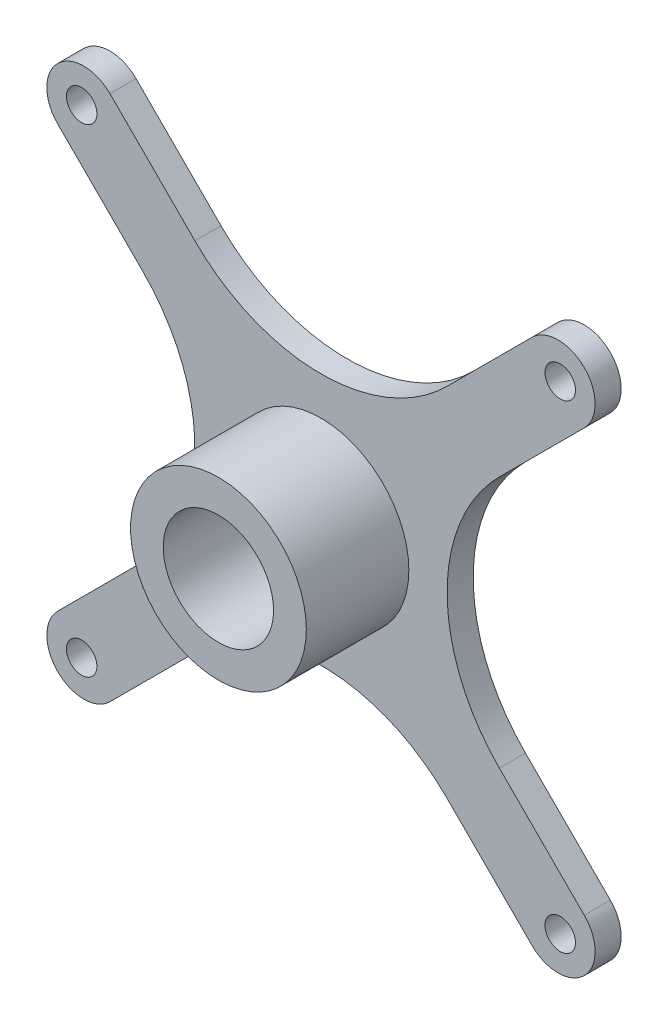
ISO-10303-21;
HEADER;
FILE_DESCRIPTION(('STEP AP214'),'2;1');
FILE_NAME('part.step','',(''),(''),'','','');
FILE_SCHEMA(('AUTOMOTIVE_DESIGN { 1 0 10303 214 1 1 1 1 }'));
ENDSEC;
DATA;
#1=APPLICATION_CONTEXT('core data for automotive mechanical design processes');
#2=APPLICATION_PROTOCOL_DEFINITION('international standard','automotive_design',2000,#1);
#3=PRODUCT_CONTEXT('',#1,'mechanical');
#4=PRODUCT('Part','Part','',(#3));
#5=PRODUCT_RELATED_PRODUCT_CATEGORY('part','',(#4));
#6=PRODUCT_DEFINITION_FORMATION('','',#4);
#7=PRODUCT_DEFINITION_CONTEXT('part definition',#1,'design');
#8=PRODUCT_DEFINITION('design','',#6,#7);
#9=PRODUCT_DEFINITION_SHAPE('','',#8);
#10=(LENGTH_UNIT() NAMED_UNIT(*) SI_UNIT(.MILLI.,.METRE.));
#11=(NAMED_UNIT(*) PLANE_ANGLE_UNIT() SI_UNIT($,.RADIAN.));
#12=(NAMED_UNIT(*) SI_UNIT($,.STERADIAN.) SOLID_ANGLE_UNIT());
#13=UNCERTAINTY_MEASURE_WITH_UNIT(LENGTH_MEASURE(1.E-05),#10,'distance_accuracy_value','');
#14=(GEOMETRIC_REPRESENTATION_CONTEXT(3) GLOBAL_UNCERTAINTY_ASSIGNED_CONTEXT((#13)) GLOBAL_UNIT_ASSIGNED_CONTEXT((#10,
#11,#12)) REPRESENTATION_CONTEXT('',''));
#15=CARTESIAN_POINT('',(0.,0.,0.));
#16=DIRECTION('',(0.,0.,1.));
#17=DIRECTION('',(1.,0.,0.));
#18=AXIS2_PLACEMENT_3D('',#15,#16,#17);
#19=CARTESIAN_POINT('',(0.,0.,1.78));
#20=DIRECTION('',(0.,0.,1.));
#21=DIRECTION('',(1.,0.,0.));
#22=AXIS2_PLACEMENT_3D('',#19,#20,#21);
#23=PLANE('',#22);
#24=CARTESIAN_POINT('',(16.3346089475665,16.3346089475661,1.78));
#25=DIRECTION('',(0.,0.,1.));
#26=DIRECTION('',(1.,0.,0.));
#27=AXIS2_PLACEMENT_3D('',#24,#25,#26);
#28=CIRCLE('',#27,1.0399999999996);
#29=CARTESIAN_POINT('',(17.3746089475661,16.3346089475661,1.78));
#30=VERTEX_POINT('',#29);
#31=EDGE_CURVE('E189',#30,#30,#28,.T.);
#32=ORIENTED_EDGE('',*,*,#31,.F.);
#33=EDGE_LOOP('',(#32));
#34=FACE_BOUND('',#33,.T.);
#35=CARTESIAN_POINT('',(-16.3346089475658,16.3346089475662,1.78));
#36=DIRECTION('',(0.,0.,1.));
#37=DIRECTION('',(1.,0.,0.));
#38=AXIS2_PLACEMENT_3D('',#35,#36,#37);
#39=CIRCLE('',#38,1.0399999999996);
#40=CARTESIAN_POINT('',(-15.2946089475662,16.3346089475662,1.78));
#41=VERTEX_POINT('',#40);
#42=EDGE_CURVE('E186',#41,#41,#39,.T.);
#43=ORIENTED_EDGE('',*,*,#42,.F.);
#44=EDGE_LOOP('',(#43));
#45=FACE_BOUND('',#44,.T.);
#46=CARTESIAN_POINT('',(-16.3346089475653,-16.3346089475656,1.78));
#47=DIRECTION('',(0.,0.,1.));
#48=DIRECTION('',(1.,0.,0.));
#49=AXIS2_PLACEMENT_3D('',#46,#47,#48);
#50=CIRCLE('',#49,1.0399999999996);
#51=CARTESIAN_POINT('',(-15.2946089475657,-16.3346089475656,1.78));
#52=VERTEX_POINT('',#51);
#53=EDGE_CURVE('E183',#52,#52,#50,.T.);
#54=ORIENTED_EDGE('',*,*,#53,.F.);
#55=EDGE_LOOP('',(#54));
#56=FACE_BOUND('',#55,.T.);
#57=CARTESIAN_POINT('',(16.3346089475664,-16.3346089475662,1.78));
#58=DIRECTION('',(0.,0.,1.));
#59=DIRECTION('',(1.,0.,0.));
#60=AXIS2_PLACEMENT_3D('',#57,#58,#59);
#61=CIRCLE('',#60,1.0399999999996);
#62=CARTESIAN_POINT('',(17.3746089475661,-16.3346089475662,1.78));
#63=VERTEX_POINT('',#62);
#64=EDGE_CURVE('E177',#63,#63,#61,.T.);
#65=ORIENTED_EDGE('',*,*,#64,.F.);
#66=EDGE_LOOP('',(#65));
#67=FACE_BOUND('',#66,.T.);
#68=DIRECTION('',(0.707106781186552,-0.707106781186543,0.));
#69=VECTOR('',#68,1.);
#70=CARTESIAN_POINT('',(-1.78544462249585,-1.78544462249587,1.78));
#71=LINE('',#70,#69);
#72=CARTESIAN_POINT('',(-17.9749999999999,14.404110755008,1.78));
#73=VERTEX_POINT('',#72);
#74=CARTESIAN_POINT('',(-12.1775605948521,8.60667134986025,1.78));
#75=VERTEX_POINT('',#74);
#76=EDGE_CURVE('E116',#73,#75,#71,.T.);
#77=ORIENTED_EDGE('',*,*,#76,.T.);
#78=CARTESIAN_POINT('',(-20.7842319447123,0.,1.78));
#79=DIRECTION('',(0.,0.,1.));
#80=DIRECTION('',(1.,0.,0.));
#81=AXIS2_PLACEMENT_3D('',#78,#79,#80);
#82=CIRCLE('',#81,12.1716713498603);
#83=CARTESIAN_POINT('',(-12.1775605948521,-8.60667134986025,1.78));
#84=VERTEX_POINT('',#83);
#85=EDGE_CURVE('E676',#84,#75,#82,.T.);
#86=ORIENTED_EDGE('',*,*,#85,.F.);
#87=DIRECTION('',(0.707106781186552,0.707106781186543,0.));
#88=VECTOR('',#87,1.);
#89=CARTESIAN_POINT('',(-1.78544462249586,1.78544462249588,1.78));
#90=LINE('',#89,#88);
#91=CARTESIAN_POINT('',(-17.9749999999999,-14.404110755008,1.78));
#92=VERTEX_POINT('',#91);
#93=EDGE_CURVE('E280',#92,#84,#90,.T.);
#94=ORIENTED_EDGE('',*,*,#93,.F.);
#95=CARTESIAN_POINT('',(-16.1895553775038,-16.1895553775041,1.78));
#96=DIRECTION('',(0.,0.,1.));
#97=DIRECTION('',(1.,0.,0.));
#98=AXIS2_PLACEMENT_3D('',#95,#96,#97);
#99=CIRCLE('',#98,2.52500000000009);
#100=CARTESIAN_POINT('',(-14.4041107550077,-17.9750000000002,1.78));
#101=VERTEX_POINT('',#100);
#102=EDGE_CURVE('E302',#92,#101,#99,.T.);
#103=ORIENTED_EDGE('',*,*,#102,.T.);
#104=DIRECTION('',(0.707106781186543,0.707106781186552,0.));
#105=VECTOR('',#104,1.);
#106=CARTESIAN_POINT('',(1.78544462249618,-1.78544462249615,1.78));
#107=LINE('',#106,#105);
#108=CARTESIAN_POINT('',(-8.60667134985995,-12.1775605948524,1.78));
#109=VERTEX_POINT('',#108);
#110=EDGE_CURVE('E298',#101,#109,#107,.T.);
#111=ORIENTED_EDGE('',*,*,#110,.T.);
#112=CARTESIAN_POINT('',(3.05659886288592E-13,-20.7842319447126,1.78));
#113=DIRECTION('',(0.,0.,1.));
#114=DIRECTION('',(1.,0.,0.));
#115=AXIS2_PLACEMENT_3D('',#112,#113,#114);
#116=CIRCLE('',#115,12.1716713498603);
#117=CARTESIAN_POINT('',(8.60667134986056,-12.1775605948524,1.78));
#118=VERTEX_POINT('',#117);
#119=EDGE_CURVE('E301',#118,#109,#116,.T.);
#120=ORIENTED_EDGE('',*,*,#119,.F.);
#121=DIRECTION('',(-0.707106781186544,0.707106781186552,0.));
#122=VECTOR('',#121,1.);
#123=CARTESIAN_POINT('',(-1.78544462249588,-1.78544462249586,1.78));
#124=LINE('',#123,#122);
#125=CARTESIAN_POINT('',(14.4041107550083,-17.9750000000002,1.78));
#126=VERTEX_POINT('',#125);
#127=EDGE_CURVE('E304',#126,#118,#124,.T.);
#128=ORIENTED_EDGE('',*,*,#127,.F.);
#129=CARTESIAN_POINT('',(16.1895553775044,-16.1895553775041,1.78));
#130=DIRECTION('',(0.,0.,1.));
#131=DIRECTION('',(1.,0.,0.));
#132=AXIS2_PLACEMENT_3D('',#129,#130,#131);
#133=CIRCLE('',#132,2.52500000000009);
#134=CARTESIAN_POINT('',(17.9750000000005,-14.404110755008,1.78));
#135=VERTEX_POINT('',#134);
#136=EDGE_CURVE('E311',#126,#135,#133,.T.);
#137=ORIENTED_EDGE('',*,*,#136,.T.);
#138=DIRECTION('',(-0.707106781186552,0.707106781186543,0.));
#139=VECTOR('',#138,1.);
#140=CARTESIAN_POINT('',(1.78544462249615,1.78544462249618,1.78));
#141=LINE('',#140,#139);
#142=CARTESIAN_POINT('',(12.1775605948527,-8.60667134986025,1.78));
#143=VERTEX_POINT('',#142);
#144=EDGE_CURVE('E313',#135,#143,#141,.T.);
#145=ORIENTED_EDGE('',*,*,#144,.T.);
#146=CARTESIAN_POINT('',(20.7842319447129,0.,1.78));
#147=DIRECTION('',(0.,0.,1.));
#148=DIRECTION('',(1.,0.,0.));
#149=AXIS2_PLACEMENT_3D('',#146,#147,#148);
#150=CIRCLE('',#149,12.1716713498603);
#151=CARTESIAN_POINT('',(12.1775605948527,8.60667134986026,1.78));
#152=VERTEX_POINT('',#151);
#153=EDGE_CURVE('E315',#152,#143,#150,.T.);
#154=ORIENTED_EDGE('',*,*,#153,.F.);
#155=DIRECTION('',(-0.707106781186552,-0.707106781186543,0.));
#156=VECTOR('',#155,1.);
#157=CARTESIAN_POINT('',(1.78544462249616,-1.78544462249618,1.78));
#158=LINE('',#157,#156);
#159=CARTESIAN_POINT('',(17.9750000000005,14.404110755008,1.78));
#160=VERTEX_POINT('',#159);
#161=EDGE_CURVE('E318',#160,#152,#158,.T.);
#162=ORIENTED_EDGE('',*,*,#161,.F.);
#163=CARTESIAN_POINT('',(16.1895553775044,16.1895553775041,1.78));
#164=DIRECTION('',(0.,0.,1.));
#165=DIRECTION('',(1.,0.,0.));
#166=AXIS2_PLACEMENT_3D('',#163,#164,#165);
#167=CIRCLE('',#166,2.52500000000009);
#168=CARTESIAN_POINT('',(14.4041107550083,17.9750000000002,1.78));
#169=VERTEX_POINT('',#168);
#170=EDGE_CURVE('E321',#160,#169,#167,.T.);
#171=ORIENTED_EDGE('',*,*,#170,.T.);
#172=DIRECTION('',(-0.707106781186543,-0.707106781186552,0.));
#173=VECTOR('',#172,1.);
#174=CARTESIAN_POINT('',(-1.78544462249587,1.78544462249585,1.78));
#175=LINE('',#174,#173);
#176=CARTESIAN_POINT('',(8.60667134986056,12.1775605948524,1.78));
#177=VERTEX_POINT('',#176);
#178=EDGE_CURVE('E172',#169,#177,#175,.T.);
#179=ORIENTED_EDGE('',*,*,#178,.T.);
#180=CARTESIAN_POINT('',(3.00569217664203E-13,20.7842319447126,1.78));
#181=DIRECTION('',(0.,0.,1.));
#182=DIRECTION('',(1.,0.,0.));
#183=AXIS2_PLACEMENT_3D('',#180,#181,#182);
#184=CIRCLE('',#183,12.1716713498603);
#185=CARTESIAN_POINT('',(-8.60667134985995,12.1775605948524,1.78));
#186=VERTEX_POINT('',#185);
#187=EDGE_CURVE('E160',#186,#177,#184,.T.);
#188=ORIENTED_EDGE('',*,*,#187,.F.);
#189=DIRECTION('',(0.707106781186544,-0.707106781186552,0.));
#190=VECTOR('',#189,1.);
#191=CARTESIAN_POINT('',(1.78544462249618,1.78544462249616,1.78));
#192=LINE('',#191,#190);
#193=CARTESIAN_POINT('',(-14.4041107550077,17.9750000000002,1.78));
#194=VERTEX_POINT('',#193);
#195=EDGE_CURVE('E170',#194,#186,#192,.T.);
#196=ORIENTED_EDGE('',*,*,#195,.F.);
#197=CARTESIAN_POINT('',(-16.1895553775038,16.1895553775041,1.78));
#198=DIRECTION('',(0.,0.,1.));
#199=DIRECTION('',(1.,0.,0.));
#200=AXIS2_PLACEMENT_3D('',#197,#198,#199);
#201=CIRCLE('',#200,2.52500000000009);
#202=EDGE_CURVE('E56',#194,#73,#201,.T.);
#203=ORIENTED_EDGE('',*,*,#202,.T.);
#204=EDGE_LOOP('',(#77,#86,#94,#103,#111,#120,#128,#137,#145,#154,#162,#171,#179,#188,#196,#203));
#205=FACE_BOUND('',#204,.T.);
#206=CARTESIAN_POINT('',(0.,0.,1.78));
#207=DIRECTION('',(0.,0.,1.));
#208=DIRECTION('',(1.,0.,0.));
#209=AXIS2_PLACEMENT_3D('',#206,#207,#208);
#210=CIRCLE('',#209,6.);
#211=CARTESIAN_POINT('',(6.,0.,1.78));
#212=VERTEX_POINT('',#211);
#213=EDGE_CURVE('E668',#212,#212,#210,.T.);
#214=ORIENTED_EDGE('',*,*,#213,.F.);
#215=EDGE_LOOP('',(#214));
#216=FACE_BOUND('',#215,.T.);
#217=ADVANCED_FACE('F39',(#34,#45,#56,#67,#205,#216),#23,.T.);
#218=CARTESIAN_POINT('',(-1.78544462249585,-1.78544462249587,1.78));
#219=DIRECTION('',(0.707106781186543,0.707106781186552,0.));
#220=DIRECTION('',(-0.707106781186552,0.707106781186543,0.));
#221=AXIS2_PLACEMENT_3D('',#218,#219,#220);
#222=PLANE('',#221);
#223=DIRECTION('',(0.707106781186552,-0.707106781186543,0.));
#224=VECTOR('',#223,1.);
#225=CARTESIAN_POINT('',(-1.78544462249585,-1.78544462249587,0.));
#226=LINE('',#225,#224);
#227=CARTESIAN_POINT('',(-17.9749999999999,14.404110755008,0.));
#228=VERTEX_POINT('',#227);
#229=CARTESIAN_POINT('',(-12.1775605948521,8.60667134986025,0.));
#230=VERTEX_POINT('',#229);
#231=EDGE_CURVE('E193',#228,#230,#226,.T.);
#232=ORIENTED_EDGE('',*,*,#231,.T.);
#233=DIRECTION('',(0.,0.,-1.));
#234=VECTOR('',#233,1.);
#235=CARTESIAN_POINT('',(-12.1775605948521,8.60667134986025,1.78));
#236=LINE('',#235,#234);
#237=EDGE_CURVE('E11',#75,#230,#236,.T.);
#238=ORIENTED_EDGE('',*,*,#237,.F.);
#239=ORIENTED_EDGE('',*,*,#76,.F.);
#240=DIRECTION('',(0.,0.,-1.));
#241=VECTOR('',#240,1.);
#242=CARTESIAN_POINT('',(-17.9749999999999,14.404110755008,1.78));
#243=LINE('',#242,#241);
#244=EDGE_CURVE('E192',#73,#228,#243,.T.);
#245=ORIENTED_EDGE('',*,*,#244,.T.);
#246=EDGE_LOOP('',(#232,#238,#239,#245));
#247=FACE_BOUND('',#246,.T.);
#248=ADVANCED_FACE('F41',(#247),#222,.F.);
#249=CARTESIAN_POINT('',(-20.7842319447123,0.,1.78));
#250=DIRECTION('',(0.,0.,-1.));
#251=DIRECTION('',(-1.,0.,0.));
#252=AXIS2_PLACEMENT_3D('',#249,#250,#251);
#253=CYLINDRICAL_SURFACE('',#252,12.1716713498603);
#254=CARTESIAN_POINT('',(-20.7842319447123,0.,0.));
#255=DIRECTION('',(0.,0.,1.));
#256=DIRECTION('',(1.,0.,0.));
#257=AXIS2_PLACEMENT_3D('',#254,#255,#256);
#258=CIRCLE('',#257,12.1716713498603);
#259=CARTESIAN_POINT('',(-12.1775605948521,-8.60667134986025,0.));
#260=VERTEX_POINT('',#259);
#261=EDGE_CURVE('E196',#260,#230,#258,.T.);
#262=ORIENTED_EDGE('',*,*,#261,.F.);
#263=DIRECTION('',(0.,0.,-1.));
#264=VECTOR('',#263,1.);
#265=CARTESIAN_POINT('',(-12.1775605948521,-8.60667134986025,1.78));
#266=LINE('',#265,#264);
#267=EDGE_CURVE('E48',#84,#260,#266,.T.);
#268=ORIENTED_EDGE('',*,*,#267,.F.);
#269=ORIENTED_EDGE('',*,*,#85,.T.);
#270=ORIENTED_EDGE('',*,*,#237,.T.);
#271=EDGE_LOOP('',(#262,#268,#269,#270));
#272=FACE_BOUND('',#271,.T.);
#273=ADVANCED_FACE('F283',(#272),#253,.F.);
#274=CARTESIAN_POINT('',(-1.78544462249586,1.78544462249588,1.78));
#275=DIRECTION('',(-0.707106781186543,0.707106781186552,0.));
#276=DIRECTION('',(-0.707106781186552,-0.707106781186543,0.));
#277=AXIS2_PLACEMENT_3D('',#274,#275,#276);
#278=PLANE('',#277);
#279=DIRECTION('',(0.707106781186552,0.707106781186543,0.));
#280=VECTOR('',#279,1.);
#281=CARTESIAN_POINT('',(-1.78544462249586,1.78544462249588,0.));
#282=LINE('',#281,#280);
#283=CARTESIAN_POINT('',(-17.9749999999999,-14.404110755008,0.));
#284=VERTEX_POINT('',#283);
#285=EDGE_CURVE('E200',#284,#260,#282,.T.);
#286=ORIENTED_EDGE('',*,*,#285,.F.);
#287=DIRECTION('',(0.,0.,-1.));
#288=VECTOR('',#287,1.);
#289=CARTESIAN_POINT('',(-17.9749999999999,-14.404110755008,1.78));
#290=LINE('',#289,#288);
#291=EDGE_CURVE('E273',#92,#284,#290,.T.);
#292=ORIENTED_EDGE('',*,*,#291,.F.);
#293=ORIENTED_EDGE('',*,*,#93,.T.);
#294=ORIENTED_EDGE('',*,*,#267,.T.);
#295=EDGE_LOOP('',(#286,#292,#293,#294));
#296=FACE_BOUND('',#295,.T.);
#297=ADVANCED_FACE('F278',(#296),#278,.T.);
#298=CARTESIAN_POINT('',(-16.1895553775038,-16.1895553775041,1.78));
#299=DIRECTION('',(0.,0.,-1.));
#300=DIRECTION('',(-1.,0.,0.));
#301=AXIS2_PLACEMENT_3D('',#298,#299,#300);
#302=CYLINDRICAL_SURFACE('',#301,2.52500000000009);
#303=CARTESIAN_POINT('',(-16.1895553775038,-16.1895553775041,0.));
#304=DIRECTION('',(0.,0.,1.));
#305=DIRECTION('',(1.,0.,0.));
#306=AXIS2_PLACEMENT_3D('',#303,#304,#305);
#307=CIRCLE('',#306,2.52500000000009);
#308=CARTESIAN_POINT('',(-14.4041107550077,-17.9750000000002,0.));
#309=VERTEX_POINT('',#308);
#310=EDGE_CURVE('E203',#284,#309,#307,.T.);
#311=ORIENTED_EDGE('',*,*,#310,.T.);
#312=DIRECTION('',(0.,0.,-1.));
#313=VECTOR('',#312,1.);
#314=CARTESIAN_POINT('',(-14.4041107550077,-17.9750000000002,1.78));
#315=LINE('',#314,#313);
#316=EDGE_CURVE('E270',#101,#309,#315,.T.);
#317=ORIENTED_EDGE('',*,*,#316,.F.);
#318=ORIENTED_EDGE('',*,*,#102,.F.);
#319=ORIENTED_EDGE('',*,*,#291,.T.);
#320=EDGE_LOOP('',(#311,#317,#318,#319));
#321=FACE_BOUND('',#320,.T.);
#322=ADVANCED_FACE('F292',(#321),#302,.T.);
#323=CARTESIAN_POINT('',(1.78544462249618,-1.78544462249615,1.78));
#324=DIRECTION('',(-0.707106781186552,0.707106781186543,0.));
#325=DIRECTION('',(-0.707106781186543,-0.707106781186552,0.));
#326=AXIS2_PLACEMENT_3D('',#323,#324,#325);
#327=PLANE('',#326);
#328=DIRECTION('',(0.707106781186543,0.707106781186552,0.));
#329=VECTOR('',#328,1.);
#330=CARTESIAN_POINT('',(1.78544462249618,-1.78544462249615,0.));
#331=LINE('',#330,#329);
#332=CARTESIAN_POINT('',(-8.60667134985995,-12.1775605948524,0.));
#333=VERTEX_POINT('',#332);
#334=EDGE_CURVE('E205',#309,#333,#331,.T.);
#335=ORIENTED_EDGE('',*,*,#334,.T.);
#336=DIRECTION('',(0.,0.,-1.));
#337=VECTOR('',#336,1.);
#338=CARTESIAN_POINT('',(-8.60667134985995,-12.1775605948524,1.78));
#339=LINE('',#338,#337);
#340=EDGE_CURVE('E268',#109,#333,#339,.T.);
#341=ORIENTED_EDGE('',*,*,#340,.F.);
#342=ORIENTED_EDGE('',*,*,#110,.F.);
#343=ORIENTED_EDGE('',*,*,#316,.T.);
#344=EDGE_LOOP('',(#335,#341,#342,#343));
#345=FACE_BOUND('',#344,.T.);
#346=ADVANCED_FACE('F296',(#345),#327,.F.);
#347=CARTESIAN_POINT('',(3.05659886288592E-13,-20.7842319447126,1.78));
#348=DIRECTION('',(0.,0.,-1.));
#349=DIRECTION('',(-1.,0.,0.));
#350=AXIS2_PLACEMENT_3D('',#347,#348,#349);
#351=CYLINDRICAL_SURFACE('',#350,12.1716713498603);
#352=CARTESIAN_POINT('',(3.05659886288592E-13,-20.7842319447126,0.));
#353=DIRECTION('',(0.,0.,1.));
#354=DIRECTION('',(1.,0.,0.));
#355=AXIS2_PLACEMENT_3D('',#352,#353,#354);
#356=CIRCLE('',#355,12.1716713498603);
#357=CARTESIAN_POINT('',(8.60667134986056,-12.1775605948524,0.));
#358=VERTEX_POINT('',#357);
#359=EDGE_CURVE('E208',#358,#333,#356,.T.);
#360=ORIENTED_EDGE('',*,*,#359,.F.);
#361=DIRECTION('',(0.,0.,-1.));
#362=VECTOR('',#361,1.);
#363=CARTESIAN_POINT('',(8.60667134986056,-12.1775605948524,1.78));
#364=LINE('',#363,#362);
#365=EDGE_CURVE('E266',#118,#358,#364,.T.);
#366=ORIENTED_EDGE('',*,*,#365,.F.);
#367=ORIENTED_EDGE('',*,*,#119,.T.);
#368=ORIENTED_EDGE('',*,*,#340,.T.);
#369=EDGE_LOOP('',(#360,#366,#367,#368));
#370=FACE_BOUND('',#369,.T.);
#371=ADVANCED_FACE('F542',(#370),#351,.F.);
#372=CARTESIAN_POINT('',(-1.78544462249588,-1.78544462249586,1.78));
#373=DIRECTION('',(-0.707106781186551,-0.707106781186543,0.));
#374=DIRECTION('',(0.707106781186543,-0.707106781186552,0.));
#375=AXIS2_PLACEMENT_3D('',#372,#373,#374);
#376=PLANE('',#375);
#377=DIRECTION('',(-0.707106781186544,0.707106781186552,0.));
#378=VECTOR('',#377,1.);
#379=CARTESIAN_POINT('',(-1.78544462249588,-1.78544462249586,0.));
#380=LINE('',#379,#378);
#381=CARTESIAN_POINT('',(14.4041107550083,-17.9750000000002,0.));
#382=VERTEX_POINT('',#381);
#383=EDGE_CURVE('E211',#382,#358,#380,.T.);
#384=ORIENTED_EDGE('',*,*,#383,.F.);
#385=DIRECTION('',(0.,0.,-1.));
#386=VECTOR('',#385,1.);
#387=CARTESIAN_POINT('',(14.4041107550083,-17.9750000000002,1.78));
#388=LINE('',#387,#386);
#389=EDGE_CURVE('E264',#126,#382,#388,.T.);
#390=ORIENTED_EDGE('',*,*,#389,.F.);
#391=ORIENTED_EDGE('',*,*,#127,.T.);
#392=ORIENTED_EDGE('',*,*,#365,.T.);
#393=EDGE_LOOP('',(#384,#390,#391,#392));
#394=FACE_BOUND('',#393,.T.);
#395=ADVANCED_FACE('F533',(#394),#376,.T.);
#396=CARTESIAN_POINT('',(16.1895553775044,-16.1895553775041,1.78));
#397=DIRECTION('',(0.,0.,-1.));
#398=DIRECTION('',(-1.,0.,0.));
#399=AXIS2_PLACEMENT_3D('',#396,#397,#398);
#400=CYLINDRICAL_SURFACE('',#399,2.52500000000009);
#401=CARTESIAN_POINT('',(16.1895553775044,-16.1895553775041,0.));
#402=DIRECTION('',(0.,0.,1.));
#403=DIRECTION('',(1.,0.,0.));
#404=AXIS2_PLACEMENT_3D('',#401,#402,#403);
#405=CIRCLE('',#404,2.52500000000009);
#406=CARTESIAN_POINT('',(17.9750000000005,-14.404110755008,0.));
#407=VERTEX_POINT('',#406);
#408=EDGE_CURVE('E214',#382,#407,#405,.T.);
#409=ORIENTED_EDGE('',*,*,#408,.T.);
#410=DIRECTION('',(0.,0.,-1.));
#411=VECTOR('',#410,1.);
#412=CARTESIAN_POINT('',(17.9750000000005,-14.404110755008,1.78));
#413=LINE('',#412,#411);
#414=EDGE_CURVE('E261',#135,#407,#413,.T.);
#415=ORIENTED_EDGE('',*,*,#414,.F.);
#416=ORIENTED_EDGE('',*,*,#136,.F.);
#417=ORIENTED_EDGE('',*,*,#389,.T.);
#418=EDGE_LOOP('',(#409,#415,#416,#417));
#419=FACE_BOUND('',#418,.T.);
#420=ADVANCED_FACE('F522',(#419),#400,.T.);
#421=CARTESIAN_POINT('',(1.78544462249615,1.78544462249618,1.78));
#422=DIRECTION('',(-0.707106781186543,-0.707106781186552,0.));
#423=DIRECTION('',(0.707106781186552,-0.707106781186543,0.));
#424=AXIS2_PLACEMENT_3D('',#421,#422,#423);
#425=PLANE('',#424);
#426=DIRECTION('',(-0.707106781186552,0.707106781186543,0.));
#427=VECTOR('',#426,1.);
#428=CARTESIAN_POINT('',(1.78544462249615,1.78544462249618,0.));
#429=LINE('',#428,#427);
#430=CARTESIAN_POINT('',(12.1775605948527,-8.60667134986025,0.));
#431=VERTEX_POINT('',#430);
#432=EDGE_CURVE('E216',#407,#431,#429,.T.);
#433=ORIENTED_EDGE('',*,*,#432,.T.);
#434=DIRECTION('',(0.,0.,-1.));
#435=VECTOR('',#434,1.);
#436=CARTESIAN_POINT('',(12.1775605948527,-8.60667134986025,1.78));
#437=LINE('',#436,#435);
#438=EDGE_CURVE('E259',#143,#431,#437,.T.);
#439=ORIENTED_EDGE('',*,*,#438,.F.);
#440=ORIENTED_EDGE('',*,*,#144,.F.);
#441=ORIENTED_EDGE('',*,*,#414,.T.);
#442=EDGE_LOOP('',(#433,#439,#440,#441));
#443=FACE_BOUND('',#442,.T.);
#444=ADVANCED_FACE('F512',(#443),#425,.F.);
#445=CARTESIAN_POINT('',(20.7842319447129,0.,1.78));
#446=DIRECTION('',(0.,0.,-1.));
#447=DIRECTION('',(-1.,0.,0.));
#448=AXIS2_PLACEMENT_3D('',#445,#446,#447);
#449=CYLINDRICAL_SURFACE('',#448,12.1716713498603);
#450=CARTESIAN_POINT('',(20.7842319447129,0.,0.));
#451=DIRECTION('',(0.,0.,1.));
#452=DIRECTION('',(1.,0.,0.));
#453=AXIS2_PLACEMENT_3D('',#450,#451,#452);
#454=CIRCLE('',#453,12.1716713498603);
#455=CARTESIAN_POINT('',(12.1775605948527,8.60667134986026,0.));
#456=VERTEX_POINT('',#455);
#457=EDGE_CURVE('E219',#456,#431,#454,.T.);
#458=ORIENTED_EDGE('',*,*,#457,.F.);
#459=DIRECTION('',(0.,0.,-1.));
#460=VECTOR('',#459,1.);
#461=CARTESIAN_POINT('',(12.1775605948527,8.60667134986026,1.78));
#462=LINE('',#461,#460);
#463=EDGE_CURVE('E257',#152,#456,#462,.T.);
#464=ORIENTED_EDGE('',*,*,#463,.F.);
#465=ORIENTED_EDGE('',*,*,#153,.T.);
#466=ORIENTED_EDGE('',*,*,#438,.T.);
#467=EDGE_LOOP('',(#458,#464,#465,#466));
#468=FACE_BOUND('',#467,.T.);
#469=ADVANCED_FACE('F502',(#468),#449,.F.);
#470=CARTESIAN_POINT('',(1.78544462249616,-1.78544462249618,1.78));
#471=DIRECTION('',(0.707106781186543,-0.707106781186552,0.));
#472=DIRECTION('',(0.707106781186552,0.707106781186543,0.));
#473=AXIS2_PLACEMENT_3D('',#470,#471,#472);
#474=PLANE('',#473);
#475=DIRECTION('',(-0.707106781186552,-0.707106781186543,0.));
#476=VECTOR('',#475,1.);
#477=CARTESIAN_POINT('',(1.78544462249616,-1.78544462249618,0.));
#478=LINE('',#477,#476);
#479=CARTESIAN_POINT('',(17.9750000000005,14.404110755008,0.));
#480=VERTEX_POINT('',#479);
#481=EDGE_CURVE('E222',#480,#456,#478,.T.);
#482=ORIENTED_EDGE('',*,*,#481,.F.);
#483=DIRECTION('',(0.,0.,-1.));
#484=VECTOR('',#483,1.);
#485=CARTESIAN_POINT('',(17.9750000000005,14.404110755008,1.78));
#486=LINE('',#485,#484);
#487=EDGE_CURVE('E255',#160,#480,#486,.T.);
#488=ORIENTED_EDGE('',*,*,#487,.F.);
#489=ORIENTED_EDGE('',*,*,#161,.T.);
#490=ORIENTED_EDGE('',*,*,#463,.T.);
#491=EDGE_LOOP('',(#482,#488,#489,#490));
#492=FACE_BOUND('',#491,.T.);
#493=ADVANCED_FACE('F494',(#492),#474,.T.);
#494=CARTESIAN_POINT('',(16.1895553775044,16.1895553775041,1.78));
#495=DIRECTION('',(0.,0.,-1.));
#496=DIRECTION('',(-1.,0.,0.));
#497=AXIS2_PLACEMENT_3D('',#494,#495,#496);
#498=CYLINDRICAL_SURFACE('',#497,2.52500000000009);
#499=CARTESIAN_POINT('',(16.1895553775044,16.1895553775041,0.));
#500=DIRECTION('',(0.,0.,1.));
#501=DIRECTION('',(1.,0.,0.));
#502=AXIS2_PLACEMENT_3D('',#499,#500,#501);
#503=CIRCLE('',#502,2.52500000000009);
#504=CARTESIAN_POINT('',(14.4041107550083,17.9750000000002,0.));
#505=VERTEX_POINT('',#504);
#506=EDGE_CURVE('E225',#480,#505,#503,.T.);
#507=ORIENTED_EDGE('',*,*,#506,.T.);
#508=DIRECTION('',(0.,0.,-1.));
#509=VECTOR('',#508,1.);
#510=CARTESIAN_POINT('',(14.4041107550083,17.9750000000002,1.78));
#511=LINE('',#510,#509);
#512=EDGE_CURVE('E252',#169,#505,#511,.T.);
#513=ORIENTED_EDGE('',*,*,#512,.F.);
#514=ORIENTED_EDGE('',*,*,#170,.F.);
#515=ORIENTED_EDGE('',*,*,#487,.T.);
#516=EDGE_LOOP('',(#507,#513,#514,#515));
#517=FACE_BOUND('',#516,.T.);
#518=ADVANCED_FACE('F327',(#517),#498,.T.);
#519=CARTESIAN_POINT('',(-1.78544462249587,1.78544462249585,1.78));
#520=DIRECTION('',(0.707106781186552,-0.707106781186543,0.));
#521=DIRECTION('',(0.707106781186543,0.707106781186552,0.));
#522=AXIS2_PLACEMENT_3D('',#519,#520,#521);
#523=PLANE('',#522);
#524=DIRECTION('',(-0.707106781186543,-0.707106781186552,0.));
#525=VECTOR('',#524,1.);
#526=CARTESIAN_POINT('',(-1.78544462249587,1.78544462249585,0.));
#527=LINE('',#526,#525);
#528=CARTESIAN_POINT('',(8.60667134986056,12.1775605948524,0.));
#529=VERTEX_POINT('',#528);
#530=EDGE_CURVE('E227',#505,#529,#527,.T.);
#531=ORIENTED_EDGE('',*,*,#530,.T.);
#532=DIRECTION('',(0.,0.,-1.));
#533=VECTOR('',#532,1.);
#534=CARTESIAN_POINT('',(8.60667134986056,12.1775605948524,1.78));
#535=LINE('',#534,#533);
#536=EDGE_CURVE('E167',#177,#529,#535,.T.);
#537=ORIENTED_EDGE('',*,*,#536,.F.);
#538=ORIENTED_EDGE('',*,*,#178,.F.);
#539=ORIENTED_EDGE('',*,*,#512,.T.);
#540=EDGE_LOOP('',(#531,#537,#538,#539));
#541=FACE_BOUND('',#540,.T.);
#542=ADVANCED_FACE('F331',(#541),#523,.F.);
#543=CARTESIAN_POINT('',(3.00569217664203E-13,20.7842319447126,1.78));
#544=DIRECTION('',(0.,0.,-1.));
#545=DIRECTION('',(-1.,0.,0.));
#546=AXIS2_PLACEMENT_3D('',#543,#544,#545);
#547=CYLINDRICAL_SURFACE('',#546,12.1716713498603);
#548=CARTESIAN_POINT('',(3.00569217664203E-13,20.7842319447126,0.));
#549=DIRECTION('',(0.,0.,1.));
#550=DIRECTION('',(1.,0.,0.));
#551=AXIS2_PLACEMENT_3D('',#548,#549,#550);
#552=CIRCLE('',#551,12.1716713498603);
#553=CARTESIAN_POINT('',(-8.60667134985995,12.1775605948524,0.));
#554=VERTEX_POINT('',#553);
#555=EDGE_CURVE('E162',#554,#529,#552,.T.);
#556=ORIENTED_EDGE('',*,*,#555,.F.);
#557=DIRECTION('',(0.,0.,-1.));
#558=VECTOR('',#557,1.);
#559=CARTESIAN_POINT('',(-8.60667134985995,12.1775605948524,1.78));
#560=LINE('',#559,#558);
#561=EDGE_CURVE('E157',#186,#554,#560,.T.);
#562=ORIENTED_EDGE('',*,*,#561,.F.);
#563=ORIENTED_EDGE('',*,*,#187,.T.);
#564=ORIENTED_EDGE('',*,*,#536,.T.);
#565=EDGE_LOOP('',(#556,#562,#563,#564));
#566=FACE_BOUND('',#565,.T.);
#567=ADVANCED_FACE('F159',(#566),#547,.F.);
#568=CARTESIAN_POINT('',(1.78544462249618,1.78544462249616,1.78));
#569=DIRECTION('',(0.707106781186551,0.707106781186543,0.));
#570=DIRECTION('',(-0.707106781186543,0.707106781186552,0.));
#571=AXIS2_PLACEMENT_3D('',#568,#569,#570);
#572=PLANE('',#571);
#573=DIRECTION('',(0.707106781186544,-0.707106781186552,0.));
#574=VECTOR('',#573,1.);
#575=CARTESIAN_POINT('',(1.78544462249618,1.78544462249616,0.));
#576=LINE('',#575,#574);
#577=CARTESIAN_POINT('',(-14.4041107550077,17.9750000000002,0.));
#578=VERTEX_POINT('',#577);
#579=EDGE_CURVE('E231',#578,#554,#576,.T.);
#580=ORIENTED_EDGE('',*,*,#579,.F.);
#581=DIRECTION('',(0.,0.,-1.));
#582=VECTOR('',#581,1.);
#583=CARTESIAN_POINT('',(-14.4041107550077,17.9750000000002,1.78));
#584=LINE('',#583,#582);
#585=EDGE_CURVE('E107',#194,#578,#584,.T.);
#586=ORIENTED_EDGE('',*,*,#585,.F.);
#587=ORIENTED_EDGE('',*,*,#195,.T.);
#588=ORIENTED_EDGE('',*,*,#561,.T.);
#589=EDGE_LOOP('',(#580,#586,#587,#588));
#590=FACE_BOUND('',#589,.T.);
#591=ADVANCED_FACE('F175',(#590),#572,.T.);
#592=CARTESIAN_POINT('',(-16.3346089475658,16.3346089475662,1.78));
#593=DIRECTION('',(0.,0.,-1.));
#594=DIRECTION('',(-1.,0.,0.));
#595=AXIS2_PLACEMENT_3D('',#592,#593,#594);
#596=CYLINDRICAL_SURFACE('',#595,1.0399999999996);
#597=ORIENTED_EDGE('',*,*,#42,.T.);
#598=EDGE_LOOP('',(#597));
#599=FACE_BOUND('',#598,.T.);
#600=CARTESIAN_POINT('',(-16.3346089475658,16.3346089475662,0.));
#601=DIRECTION('',(0.,0.,1.));
#602=DIRECTION('',(1.,0.,0.));
#603=AXIS2_PLACEMENT_3D('',#600,#601,#602);
#604=CIRCLE('',#603,1.0399999999996);
#605=CARTESIAN_POINT('',(-15.2946089475662,16.3346089475662,0.));
#606=VERTEX_POINT('',#605);
#607=EDGE_CURVE('E243',#606,#606,#604,.T.);
#608=ORIENTED_EDGE('',*,*,#607,.F.);
#609=EDGE_LOOP('',(#608));
#610=FACE_BOUND('',#609,.T.);
#611=ADVANCED_FACE('F363',(#599,#610),#596,.F.);
#612=CARTESIAN_POINT('',(-16.3346089475653,-16.3346089475656,1.78));
#613=DIRECTION('',(0.,0.,-1.));
#614=DIRECTION('',(-1.,0.,0.));
#615=AXIS2_PLACEMENT_3D('',#612,#613,#614);
#616=CYLINDRICAL_SURFACE('',#615,1.0399999999996);
#617=ORIENTED_EDGE('',*,*,#53,.T.);
#618=EDGE_LOOP('',(#617));
#619=FACE_BOUND('',#618,.T.);
#620=CARTESIAN_POINT('',(-16.3346089475653,-16.3346089475656,0.));
#621=DIRECTION('',(0.,0.,1.));
#622=DIRECTION('',(1.,0.,0.));
#623=AXIS2_PLACEMENT_3D('',#620,#621,#622);
#624=CIRCLE('',#623,1.0399999999996);
#625=CARTESIAN_POINT('',(-15.2946089475657,-16.3346089475656,0.));
#626=VERTEX_POINT('',#625);
#627=EDGE_CURVE('E240',#626,#626,#624,.T.);
#628=ORIENTED_EDGE('',*,*,#627,.F.);
#629=EDGE_LOOP('',(#628));
#630=FACE_BOUND('',#629,.T.);
#631=ADVANCED_FACE('F366',(#619,#630),#616,.F.);
#632=CARTESIAN_POINT('',(16.3346089475664,-16.3346089475662,1.78));
#633=DIRECTION('',(0.,0.,-1.));
#634=DIRECTION('',(-1.,0.,0.));
#635=AXIS2_PLACEMENT_3D('',#632,#633,#634);
#636=CYLINDRICAL_SURFACE('',#635,1.0399999999996);
#637=ORIENTED_EDGE('',*,*,#64,.T.);
#638=EDGE_LOOP('',(#637));
#639=FACE_BOUND('',#638,.T.);
#640=CARTESIAN_POINT('',(16.3346089475664,-16.3346089475662,0.));
#641=DIRECTION('',(0.,0.,1.));
#642=DIRECTION('',(1.,0.,0.));
#643=AXIS2_PLACEMENT_3D('',#640,#641,#642);
#644=CIRCLE('',#643,1.0399999999996);
#645=CARTESIAN_POINT('',(17.3746089475661,-16.3346089475662,0.));
#646=VERTEX_POINT('',#645);
#647=EDGE_CURVE('E237',#646,#646,#644,.T.);
#648=ORIENTED_EDGE('',*,*,#647,.F.);
#649=EDGE_LOOP('',(#648));
#650=FACE_BOUND('',#649,.T.);
#651=ADVANCED_FACE('F344',(#639,#650),#636,.F.);
#652=CARTESIAN_POINT('',(0.,0.,1.78));
#653=DIRECTION('',(0.,0.,-1.));
#654=DIRECTION('',(-1.,0.,0.));
#655=AXIS2_PLACEMENT_3D('',#652,#653,#654);
#656=CYLINDRICAL_SURFACE('',#655,3.765);
#657=CARTESIAN_POINT('',(0.,0.,0.));
#658=DIRECTION('',(0.,0.,1.));
#659=DIRECTION('',(1.,0.,0.));
#660=AXIS2_PLACEMENT_3D('',#657,#658,#659);
#661=CIRCLE('',#660,3.765);
#662=CARTESIAN_POINT('',(3.765,0.,0.));
#663=VERTEX_POINT('',#662);
#664=EDGE_CURVE('E234',#663,#663,#661,.T.);
#665=ORIENTED_EDGE('',*,*,#664,.F.);
#666=EDGE_LOOP('',(#665));
#667=FACE_BOUND('',#666,.T.);
#668=CARTESIAN_POINT('',(0.,0.,8.78));
#669=DIRECTION('',(0.,0.,1.));
#670=DIRECTION('',(1.,0.,0.));
#671=AXIS2_PLACEMENT_3D('',#668,#669,#670);
#672=CIRCLE('',#671,3.765);
#673=CARTESIAN_POINT('',(3.765,0.,8.78));
#674=VERTEX_POINT('',#673);
#675=EDGE_CURVE('E669',#674,#674,#672,.T.);
#676=ORIENTED_EDGE('',*,*,#675,.T.);
#677=EDGE_LOOP('',(#676));
#678=FACE_BOUND('',#677,.T.);
#679=ADVANCED_FACE('F336',(#667,#678),#656,.F.);
#680=CARTESIAN_POINT('',(-16.1895553775038,16.1895553775041,1.78));
#681=DIRECTION('',(0.,0.,-1.));
#682=DIRECTION('',(-1.,0.,0.));
#683=AXIS2_PLACEMENT_3D('',#680,#681,#682);
#684=CYLINDRICAL_SURFACE('',#683,2.52500000000009);
#685=CARTESIAN_POINT('',(-16.1895553775038,16.1895553775041,0.));
#686=DIRECTION('',(0.,0.,1.));
#687=DIRECTION('',(1.,0.,0.));
#688=AXIS2_PLACEMENT_3D('',#685,#686,#687);
#689=CIRCLE('',#688,2.52500000000009);
#690=EDGE_CURVE('E110',#578,#228,#689,.T.);
#691=ORIENTED_EDGE('',*,*,#690,.T.);
#692=ORIENTED_EDGE('',*,*,#244,.F.);
#693=ORIENTED_EDGE('',*,*,#202,.F.);
#694=ORIENTED_EDGE('',*,*,#585,.T.);
#695=EDGE_LOOP('',(#691,#692,#693,#694));
#696=FACE_BOUND('',#695,.T.);
#697=ADVANCED_FACE('F333',(#696),#684,.T.);
#698=CARTESIAN_POINT('',(16.3346089475665,16.3346089475661,1.78));
#699=DIRECTION('',(0.,0.,-1.));
#700=DIRECTION('',(-1.,0.,0.));
#701=AXIS2_PLACEMENT_3D('',#698,#699,#700);
#702=CYLINDRICAL_SURFACE('',#701,1.0399999999996);
#703=ORIENTED_EDGE('',*,*,#31,.T.);
#704=EDGE_LOOP('',(#703));
#705=FACE_BOUND('',#704,.T.);
#706=CARTESIAN_POINT('',(16.3346089475665,16.3346089475661,0.));
#707=DIRECTION('',(0.,0.,1.));
#708=DIRECTION('',(1.,0.,0.));
#709=AXIS2_PLACEMENT_3D('',#706,#707,#708);
#710=CIRCLE('',#709,1.0399999999996);
#711=CARTESIAN_POINT('',(17.3746089475661,16.3346089475661,0.));
#712=VERTEX_POINT('',#711);
#713=EDGE_CURVE('E246',#712,#712,#710,.T.);
#714=ORIENTED_EDGE('',*,*,#713,.F.);
#715=EDGE_LOOP('',(#714));
#716=FACE_BOUND('',#715,.T.);
#717=ADVANCED_FACE('F335',(#705,#716),#702,.F.);
#718=CARTESIAN_POINT('',(0.,0.,0.));
#719=DIRECTION('',(0.,0.,1.));
#720=DIRECTION('',(1.,0.,0.));
#721=AXIS2_PLACEMENT_3D('',#718,#719,#720);
#722=PLANE('',#721);
#723=ORIENTED_EDGE('',*,*,#231,.F.);
#724=ORIENTED_EDGE('',*,*,#690,.F.);
#725=ORIENTED_EDGE('',*,*,#579,.T.);
#726=ORIENTED_EDGE('',*,*,#555,.T.);
#727=ORIENTED_EDGE('',*,*,#530,.F.);
#728=ORIENTED_EDGE('',*,*,#506,.F.);
#729=ORIENTED_EDGE('',*,*,#481,.T.);
#730=ORIENTED_EDGE('',*,*,#457,.T.);
#731=ORIENTED_EDGE('',*,*,#432,.F.);
#732=ORIENTED_EDGE('',*,*,#408,.F.);
#733=ORIENTED_EDGE('',*,*,#383,.T.);
#734=ORIENTED_EDGE('',*,*,#359,.T.);
#735=ORIENTED_EDGE('',*,*,#334,.F.);
#736=ORIENTED_EDGE('',*,*,#310,.F.);
#737=ORIENTED_EDGE('',*,*,#285,.T.);
#738=ORIENTED_EDGE('',*,*,#261,.T.);
#739=EDGE_LOOP('',(#723,#724,#725,#726,#727,#728,#729,#730,#731,#732,#733,#734,#735,#736,#737,#738));
#740=FACE_BOUND('',#739,.T.);
#741=ORIENTED_EDGE('',*,*,#664,.T.);
#742=EDGE_LOOP('',(#741));
#743=FACE_BOUND('',#742,.T.);
#744=ORIENTED_EDGE('',*,*,#647,.T.);
#745=EDGE_LOOP('',(#744));
#746=FACE_BOUND('',#745,.T.);
#747=ORIENTED_EDGE('',*,*,#627,.T.);
#748=EDGE_LOOP('',(#747));
#749=FACE_BOUND('',#748,.T.);
#750=ORIENTED_EDGE('',*,*,#607,.T.);
#751=EDGE_LOOP('',(#750));
#752=FACE_BOUND('',#751,.T.);
#753=ORIENTED_EDGE('',*,*,#713,.T.);
#754=EDGE_LOOP('',(#753));
#755=FACE_BOUND('',#754,.T.);
#756=ADVANCED_FACE('F287',(#740,#743,#746,#749,#752,#755),#722,.F.);
#757=CARTESIAN_POINT('',(0.,0.,8.78));
#758=DIRECTION('',(0.,0.,1.));
#759=DIRECTION('',(1.,0.,0.));
#760=AXIS2_PLACEMENT_3D('',#757,#758,#759);
#761=PLANE('',#760);
#762=CARTESIAN_POINT('',(0.,0.,8.78));
#763=DIRECTION('',(0.,0.,1.));
#764=DIRECTION('',(1.,0.,0.));
#765=AXIS2_PLACEMENT_3D('',#762,#763,#764);
#766=CIRCLE('',#765,6.);
#767=CARTESIAN_POINT('',(6.,0.,8.78));
#768=VERTEX_POINT('',#767);
#769=EDGE_CURVE('E197',#768,#768,#766,.T.);
#770=ORIENTED_EDGE('',*,*,#769,.T.);
#771=EDGE_LOOP('',(#770));
#772=FACE_BOUND('',#771,.T.);
#773=ORIENTED_EDGE('',*,*,#675,.F.);
#774=EDGE_LOOP('',(#773));
#775=FACE_BOUND('',#774,.T.);
#776=ADVANCED_FACE('F361',(#772,#775),#761,.T.);
#777=CARTESIAN_POINT('',(0.,0.,8.78));
#778=DIRECTION('',(0.,0.,-1.));
#779=DIRECTION('',(-1.,0.,0.));
#780=AXIS2_PLACEMENT_3D('',#777,#778,#779);
#781=CYLINDRICAL_SURFACE('',#780,6.);
#782=ORIENTED_EDGE('',*,*,#769,.F.);
#783=EDGE_LOOP('',(#782));
#784=FACE_BOUND('',#783,.T.);
#785=ORIENTED_EDGE('',*,*,#213,.T.);
#786=EDGE_LOOP('',(#785));
#787=FACE_BOUND('',#786,.T.);
#788=ADVANCED_FACE('F358',(#784,#787),#781,.T.);
#789=CLOSED_SHELL('',(#217,#248,#273,#297,#322,#346,#371,#395,#420,#444,#469,#493,#518,#542,
#567,#591,#611,#631,#651,#679,#697,#717,#756,#776,#788));
#790=MANIFOLD_SOLID_BREP('B2',#789);
#791=ADVANCED_BREP_SHAPE_REPRESENTATION('',(#18,#790),#14);
#792=SHAPE_DEFINITION_REPRESENTATION(#9,#791);
ENDSEC;
END-ISO-10303-21;
